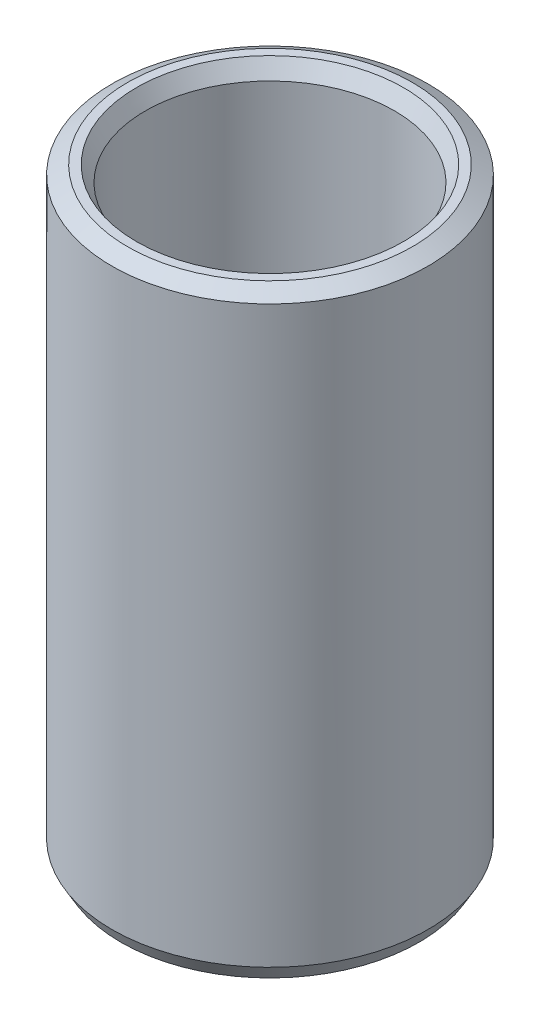
ISO-10303-21;
HEADER;
FILE_DESCRIPTION(('STEP AP214'),'2;1');
FILE_NAME('part.step','',(''),(''),'','','');
FILE_SCHEMA(('AUTOMOTIVE_DESIGN { 1 0 10303 214 1 1 1 1 }'));
ENDSEC;
DATA;
#1=APPLICATION_CONTEXT('core data for automotive mechanical design processes');
#2=APPLICATION_PROTOCOL_DEFINITION('international standard','automotive_design',2000,#1);
#3=PRODUCT_CONTEXT('',#1,'mechanical');
#4=PRODUCT('Part','Part','',(#3));
#5=PRODUCT_RELATED_PRODUCT_CATEGORY('part','',(#4));
#6=PRODUCT_DEFINITION_FORMATION('','',#4);
#7=PRODUCT_DEFINITION_CONTEXT('part definition',#1,'design');
#8=PRODUCT_DEFINITION('design','',#6,#7);
#9=PRODUCT_DEFINITION_SHAPE('','',#8);
#10=(LENGTH_UNIT() NAMED_UNIT(*) SI_UNIT(.MILLI.,.METRE.));
#11=(NAMED_UNIT(*) PLANE_ANGLE_UNIT() SI_UNIT($,.RADIAN.));
#12=(NAMED_UNIT(*) SI_UNIT($,.STERADIAN.) SOLID_ANGLE_UNIT());
#13=UNCERTAINTY_MEASURE_WITH_UNIT(LENGTH_MEASURE(1.E-05),#10,'distance_accuracy_value','');
#14=(GEOMETRIC_REPRESENTATION_CONTEXT(3) GLOBAL_UNCERTAINTY_ASSIGNED_CONTEXT((#13)) GLOBAL_UNIT_ASSIGNED_CONTEXT((#10,
#11,#12)) REPRESENTATION_CONTEXT('',''));
#15=CARTESIAN_POINT('',(0.,0.,0.));
#16=DIRECTION('',(0.,0.,1.));
#17=DIRECTION('',(1.,0.,0.));
#18=AXIS2_PLACEMENT_3D('',#15,#16,#17);
#19=CARTESIAN_POINT('',(0.,227.527161747253,0.));
#20=DIRECTION('',(0.,-1.,0.));
#21=DIRECTION('',(0.,0.,-1.));
#22=AXIS2_PLACEMENT_3D('',#19,#20,#21);
#23=CYLINDRICAL_SURFACE('',#22,60.);
#24=CARTESIAN_POINT('',(0.,5.92628424714317,0.));
#25=DIRECTION('',(0.,1.,0.));
#26=DIRECTION('',(0.,0.,1.));
#27=AXIS2_PLACEMENT_3D('',#24,#25,#26);
#28=CIRCLE('',#27,60.);
#29=CARTESIAN_POINT('',(0.,5.92628424714314,-60.));
#30=VERTEX_POINT('',#29);
#31=EDGE_CURVE('E10',#30,#30,#28,.T.);
#32=CARTESIAN_POINT('',(0.,224.105619941871,0.));
#33=DIRECTION('',(0.,1.,0.));
#34=DIRECTION('',(0.,0.,1.));
#35=AXIS2_PLACEMENT_3D('',#32,#33,#34);
#36=CIRCLE('',#35,60.);
#37=CARTESIAN_POINT('',(0.,224.105619941871,-60.));
#38=VERTEX_POINT('',#37);
#39=EDGE_CURVE('E50',#38,#38,#36,.F.);
#40=CARTESIAN_POINT('',(0.,5.92628424714314,-60.));
#41=CARTESIAN_POINT('',(0.,8.19898566062989,-60.));
#42=CARTESIAN_POINT('',(0.,10.4716870741166,-60.));
#43=CARTESIAN_POINT('',(0.,15.0170899010901,-60.));
#44=CARTESIAN_POINT('',(0.,17.2897913145769,-60.));
#45=CARTESIAN_POINT('',(0.,21.8351941415504,-60.));
#46=CARTESIAN_POINT('',(0.,24.1078955550372,-60.));
#47=CARTESIAN_POINT('',(0.,28.6532983820107,-60.));
#48=CARTESIAN_POINT('',(0.,30.9259997954974,-60.));
#49=CARTESIAN_POINT('',(0.,35.4714026224709,-60.));
#50=CARTESIAN_POINT('',(0.,37.7441040359577,-60.));
#51=CARTESIAN_POINT('',(0.,42.2895068629312,-60.));
#52=CARTESIAN_POINT('',(0.,44.5622082764179,-60.));
#53=CARTESIAN_POINT('',(0.,49.1076111033914,-60.));
#54=CARTESIAN_POINT('',(0.,51.3803125168782,-60.));
#55=CARTESIAN_POINT('',(0.,55.9257153438517,-60.));
#56=CARTESIAN_POINT('',(0.,58.1984167573384,-60.));
#57=CARTESIAN_POINT('',(0.,62.7438195843119,-60.));
#58=CARTESIAN_POINT('',(0.,65.0165209977987,-60.));
#59=CARTESIAN_POINT('',(0.,69.5619238247722,-60.));
#60=CARTESIAN_POINT('',(0.,71.8346252382589,-60.));
#61=CARTESIAN_POINT('',(0.,76.3800280652324,-60.));
#62=CARTESIAN_POINT('',(0.,78.6527294787192,-60.));
#63=CARTESIAN_POINT('',(0.,83.1981323056927,-60.));
#64=CARTESIAN_POINT('',(0.,85.4708337191794,-60.));
#65=CARTESIAN_POINT('',(0.,90.0162365461529,-60.));
#66=CARTESIAN_POINT('',(0.,92.2889379596397,-60.));
#67=CARTESIAN_POINT('',(0.,96.8343407866132,-60.));
#68=CARTESIAN_POINT('',(0.,99.1070422000999,-60.));
#69=CARTESIAN_POINT('',(0.,103.652445027073,-60.));
#70=CARTESIAN_POINT('',(0.,105.92514644056,-60.));
#71=CARTESIAN_POINT('',(0.,110.470549267534,-60.));
#72=CARTESIAN_POINT('',(0.,112.74325068102,-60.));
#73=CARTESIAN_POINT('',(0.,117.288653507994,-60.));
#74=CARTESIAN_POINT('',(0.,119.561354921481,-60.));
#75=CARTESIAN_POINT('',(0.,124.106757748454,-60.));
#76=CARTESIAN_POINT('',(0.,126.379459161941,-60.));
#77=CARTESIAN_POINT('',(0.,130.924861988914,-60.));
#78=CARTESIAN_POINT('',(0.,133.197563402401,-60.));
#79=CARTESIAN_POINT('',(0.,137.742966229375,-60.));
#80=CARTESIAN_POINT('',(0.,140.015667642861,-60.));
#81=CARTESIAN_POINT('',(0.,144.561070469835,-60.));
#82=CARTESIAN_POINT('',(0.,146.833771883322,-60.));
#83=CARTESIAN_POINT('',(0.,151.379174710295,-60.));
#84=CARTESIAN_POINT('',(0.,153.651876123782,-60.));
#85=CARTESIAN_POINT('',(0.,158.197278950755,-60.));
#86=CARTESIAN_POINT('',(0.,160.469980364242,-60.));
#87=CARTESIAN_POINT('',(0.,165.015383191216,-60.));
#88=CARTESIAN_POINT('',(0.,167.288084604702,-60.));
#89=CARTESIAN_POINT('',(0.,171.833487431676,-60.));
#90=CARTESIAN_POINT('',(0.,174.106188845163,-60.));
#91=CARTESIAN_POINT('',(0.,178.651591672136,-60.));
#92=CARTESIAN_POINT('',(0.,180.924293085623,-60.));
#93=CARTESIAN_POINT('',(0.,185.469695912596,-60.));
#94=CARTESIAN_POINT('',(0.,187.742397326083,-60.));
#95=CARTESIAN_POINT('',(0.,192.287800153057,-60.));
#96=CARTESIAN_POINT('',(0.,194.560501566543,-60.));
#97=CARTESIAN_POINT('',(0.,199.105904393517,-60.));
#98=CARTESIAN_POINT('',(0.,201.378605807004,-60.));
#99=CARTESIAN_POINT('',(0.,205.924008633977,-60.));
#100=CARTESIAN_POINT('',(0.,208.196710047464,-60.));
#101=CARTESIAN_POINT('',(0.,212.742112874437,-60.));
#102=CARTESIAN_POINT('',(0.,215.014814287924,-60.));
#103=CARTESIAN_POINT('',(0.,219.560217114898,-60.));
#104=CARTESIAN_POINT('',(0.,221.832918528384,-60.));
#105=CARTESIAN_POINT('',(0.,224.105619941871,-60.));
#106=B_SPLINE_CURVE_WITH_KNOTS('',3,(#40,#41,#42,#43,#44,#45,#46,#47,#48,#49,#50,#51,#52,#53,
#54,#55,#56,#57,#58,#59,#60,#61,#62,#63,#64,#65,#66,#67,#68,#69,#70,#71,#72,#73,#74,#75,#76,#77,
#78,#79,#80,#81,#82,#83,#84,#85,#86,#87,#88,#89,#90,#91,#92,#93,#94,#95,#96,#97,#98,#99,#100,
#101,#102,#103,#104,#105),.UNSPECIFIED.,.F.,.F.,(4,2,2,2,2,2,2,2,2,2,2,2,2,2,2,2,2,2,2,2,2,2,2,
2,2,2,2,2,2,2,2,2,4),(0.,6.81810424046025,13.6362084809205,20.4543127213808,27.272416961841,
34.0905212023013,40.9086254427615,47.7267296832218,54.544833923682,61.3629381641423,
68.1810424046026,74.9991466450628,81.817250885523,88.6353551259833,95.4534593664435,
102.271563606904,109.089667847364,115.907772087824,122.725876328285,129.543980568745,
136.362084809205,143.180189049665,149.998293290126,156.816397530586,163.634501771046,
170.452606011506,177.270710251967,184.088814492427,190.906918732887,197.725022973347,
204.543127213808,211.361231454268,218.179335694728),.UNSPECIFIED.);
#107=EDGE_CURVE('BSEAM39',#30,#38,#106,.T.);
#108=ORIENTED_EDGE('',*,*,#31,.T.);
#109=ORIENTED_EDGE('',*,*,#39,.T.);
#110=ORIENTED_EDGE('',*,*,#107,.T.);
#111=ORIENTED_EDGE('',*,*,#107,.F.);
#112=EDGE_LOOP('',(#108,#110,#109,#111));
#113=FACE_BOUND('',#112,.T.);
#114=ADVANCED_FACE('F39',(#113),#23,.T.);
#115=CARTESIAN_POINT('',(0.,227.527161747253,0.));
#116=DIRECTION('',(0.,1.,0.));
#117=DIRECTION('',(0.,0.,1.));
#118=AXIS2_PLACEMENT_3D('',#115,#116,#117);
#119=PLANE('',#118);
#120=CARTESIAN_POINT('',(0.,227.527161747253,0.));
#121=DIRECTION('',(0.,1.,0.));
#122=DIRECTION('',(0.,0.,1.));
#123=AXIS2_PLACEMENT_3D('',#120,#121,#122);
#124=CIRCLE('',#123,50.6936495553071);
#125=CARTESIAN_POINT('',(0.,227.527161747253,50.6936495553071));
#126=VERTEX_POINT('',#125);
#127=EDGE_CURVE('E58',#126,#126,#124,.F.);
#128=ORIENTED_EDGE('',*,*,#127,.T.);
#129=EDGE_LOOP('',(#128));
#130=FACE_BOUND('',#129,.T.);
#131=CARTESIAN_POINT('',(0.,227.527161747253,0.));
#132=DIRECTION('',(0.,1.,0.));
#133=DIRECTION('',(0.,0.,1.));
#134=AXIS2_PLACEMENT_3D('',#131,#132,#133);
#135=CIRCLE('',#134,54.0737157528574);
#136=CARTESIAN_POINT('',(0.,227.527161747253,-54.0737157528574));
#137=VERTEX_POINT('',#136);
#138=EDGE_CURVE('E61',#137,#137,#135,.T.);
#139=ORIENTED_EDGE('',*,*,#138,.T.);
#140=EDGE_LOOP('',(#139));
#141=FACE_BOUND('',#140,.T.);
#142=ADVANCED_FACE('F88',(#130,#141),#119,.T.);
#143=CARTESIAN_POINT('',(0.,0.,0.));
#144=DIRECTION('',(0.,1.,0.));
#145=DIRECTION('',(0.,0.,1.));
#146=AXIS2_PLACEMENT_3D('',#143,#144,#145);
#147=PLANE('',#146);
#148=CARTESIAN_POINT('',(0.,0.,0.));
#149=DIRECTION('',(0.,1.,0.));
#150=DIRECTION('',(0.,0.,1.));
#151=AXIS2_PLACEMENT_3D('',#148,#149,#150);
#152=CIRCLE('',#151,53.1983919970673);
#153=CARTESIAN_POINT('',(0.,0.,53.1983919970673));
#154=VERTEX_POINT('',#153);
#155=EDGE_CURVE('E51',#154,#154,#152,.T.);
#156=ORIENTED_EDGE('',*,*,#155,.T.);
#157=EDGE_LOOP('',(#156));
#158=FACE_BOUND('',#157,.T.);
#159=CARTESIAN_POINT('',(0.,0.,0.));
#160=DIRECTION('',(0.,1.,0.));
#161=DIRECTION('',(0.,0.,1.));
#162=AXIS2_PLACEMENT_3D('',#159,#160,#161);
#163=CIRCLE('',#162,56.5784581946176);
#164=CARTESIAN_POINT('',(0.,0.,56.5784581946176));
#165=VERTEX_POINT('',#164);
#166=EDGE_CURVE('E54',#165,#165,#163,.F.);
#167=ORIENTED_EDGE('',*,*,#166,.T.);
#168=EDGE_LOOP('',(#167));
#169=FACE_BOUND('',#168,.T.);
#170=ADVANCED_FACE('F83',(#158,#169),#147,.F.);
#171=CARTESIAN_POINT('',(0.,227.527161747253,0.));
#172=DIRECTION('',(0.,-1.,0.));
#173=DIRECTION('',(0.,0.,-1.));
#174=AXIS2_PLACEMENT_3D('',#171,#172,#173);
#175=CYLINDRICAL_SURFACE('',#174,47.2721077499247);
#176=CARTESIAN_POINT('',(0.,221.60087750011,0.));
#177=DIRECTION('',(0.,1.,0.));
#178=DIRECTION('',(0.,0.,1.));
#179=AXIS2_PLACEMENT_3D('',#176,#177,#178);
#180=CIRCLE('',#179,47.2721077499247);
#181=CARTESIAN_POINT('',(0.,221.60087750011,-47.2721077499247));
#182=VERTEX_POINT('',#181);
#183=EDGE_CURVE('E67',#182,#182,#180,.T.);
#184=CARTESIAN_POINT('',(0.,3.42154180538207,0.));
#185=DIRECTION('',(0.,1.,0.));
#186=DIRECTION('',(0.,0.,1.));
#187=AXIS2_PLACEMENT_3D('',#184,#185,#186);
#188=CIRCLE('',#187,47.2721077499247);
#189=CARTESIAN_POINT('',(0.,3.42154180538207,-47.2721077499247));
#190=VERTEX_POINT('',#189);
#191=EDGE_CURVE('E69',#190,#190,#188,.F.);
#192=CARTESIAN_POINT('',(0.,221.60087750011,-47.2721077499247));
#193=CARTESIAN_POINT('',(0.,219.328176086623,-47.2721077499247));
#194=CARTESIAN_POINT('',(0.,217.055474673136,-47.2721077499247));
#195=CARTESIAN_POINT('',(0.,212.510071846163,-47.2721077499247));
#196=CARTESIAN_POINT('',(0.,210.237370432676,-47.2721077499247));
#197=CARTESIAN_POINT('',(0.,205.691967605703,-47.2721077499247));
#198=CARTESIAN_POINT('',(0.,203.419266192216,-47.2721077499247));
#199=CARTESIAN_POINT('',(0.,198.873863365242,-47.2721077499247));
#200=CARTESIAN_POINT('',(0.,196.601161951756,-47.2721077499247));
#201=CARTESIAN_POINT('',(0.,192.055759124782,-47.2721077499247));
#202=CARTESIAN_POINT('',(0.,189.783057711295,-47.2721077499247));
#203=CARTESIAN_POINT('',(0.,185.237654884322,-47.2721077499247));
#204=CARTESIAN_POINT('',(0.,182.964953470835,-47.2721077499247));
#205=CARTESIAN_POINT('',(0.,178.419550643862,-47.2721077499247));
#206=CARTESIAN_POINT('',(0.,176.146849230375,-47.2721077499247));
#207=CARTESIAN_POINT('',(0.,171.601446403401,-47.2721077499247));
#208=CARTESIAN_POINT('',(0.,169.328744989915,-47.2721077499247));
#209=CARTESIAN_POINT('',(0.,164.783342162941,-47.2721077499247));
#210=CARTESIAN_POINT('',(0.,162.510640749454,-47.2721077499247));
#211=CARTESIAN_POINT('',(0.,157.965237922481,-47.2721077499247));
#212=CARTESIAN_POINT('',(0.,155.692536508994,-47.2721077499247));
#213=CARTESIAN_POINT('',(0.,151.147133682021,-47.2721077499247));
#214=CARTESIAN_POINT('',(0.,148.874432268534,-47.2721077499247));
#215=CARTESIAN_POINT('',(0.,144.32902944156,-47.2721077499247));
#216=CARTESIAN_POINT('',(0.,142.056328028074,-47.2721077499247));
#217=CARTESIAN_POINT('',(0.,137.5109252011,-47.2721077499247));
#218=CARTESIAN_POINT('',(0.,135.238223787613,-47.2721077499247));
#219=CARTESIAN_POINT('',(0.,130.69282096064,-47.2721077499247));
#220=CARTESIAN_POINT('',(0.,128.420119547153,-47.2721077499247));
#221=CARTESIAN_POINT('',(0.,123.87471672018,-47.2721077499247));
#222=CARTESIAN_POINT('',(0.,121.602015306693,-47.2721077499247));
#223=CARTESIAN_POINT('',(0.,117.056612479719,-47.2721077499247));
#224=CARTESIAN_POINT('',(0.,114.783911066233,-47.2721077499247));
#225=CARTESIAN_POINT('',(0.,110.238508239259,-47.2721077499247));
#226=CARTESIAN_POINT('',(0.,107.965806825773,-47.2721077499247));
#227=CARTESIAN_POINT('',(0.,103.420403998799,-47.2721077499247));
#228=CARTESIAN_POINT('',(0.,101.147702585312,-47.2721077499247));
#229=CARTESIAN_POINT('',(0.,96.6022997583388,-47.2721077499247));
#230=CARTESIAN_POINT('',(0.,94.329598344852,-47.2721077499247));
#231=CARTESIAN_POINT('',(0.,89.7841955178785,-47.2721077499247));
#232=CARTESIAN_POINT('',(0.,87.5114941043918,-47.2721077499247));
#233=CARTESIAN_POINT('',(0.,82.9660912774183,-47.2721077499247));
#234=CARTESIAN_POINT('',(0.,80.6933898639315,-47.2721077499247));
#235=CARTESIAN_POINT('',(0.,76.147987036958,-47.2721077499247));
#236=CARTESIAN_POINT('',(0.,73.8752856234713,-47.2721077499247));
#237=CARTESIAN_POINT('',(0.,69.3298827964978,-47.2721077499247));
#238=CARTESIAN_POINT('',(0.,67.057181383011,-47.2721077499247));
#239=CARTESIAN_POINT('',(0.,62.5117785560375,-47.2721077499247));
#240=CARTESIAN_POINT('',(0.,60.2390771425508,-47.2721077499247));
#241=CARTESIAN_POINT('',(0.,55.6936743155773,-47.2721077499247));
#242=CARTESIAN_POINT('',(0.,53.4209729020905,-47.2721077499247));
#243=CARTESIAN_POINT('',(0.,48.875570075117,-47.2721077499247));
#244=CARTESIAN_POINT('',(0.,46.6028686616303,-47.2721077499247));
#245=CARTESIAN_POINT('',(0.,42.0574658346568,-47.2721077499247));
#246=CARTESIAN_POINT('',(0.,39.78476442117,-47.2721077499247));
#247=CARTESIAN_POINT('',(0.,35.2393615941965,-47.2721077499247));
#248=CARTESIAN_POINT('',(0.,32.9666601807098,-47.2721077499247));
#249=CARTESIAN_POINT('',(0.,28.4212573537363,-47.2721077499247));
#250=CARTESIAN_POINT('',(0.,26.1485559402496,-47.2721077499247));
#251=CARTESIAN_POINT('',(0.,21.6031531132761,-47.2721077499247));
#252=CARTESIAN_POINT('',(0.,19.3304516997893,-47.2721077499247));
#253=CARTESIAN_POINT('',(0.,14.7850488728158,-47.2721077499247));
#254=CARTESIAN_POINT('',(0.,12.5123474593291,-47.2721077499247));
#255=CARTESIAN_POINT('',(0.,7.96694463235557,-47.2721077499247));
#256=CARTESIAN_POINT('',(0.,5.69424321886882,-47.2721077499247));
#257=CARTESIAN_POINT('',(0.,3.42154180538207,-47.2721077499247));
#258=B_SPLINE_CURVE_WITH_KNOTS('',3,(#192,#193,#194,#195,#196,#197,#198,#199,#200,#201,#202,
#203,#204,#205,#206,#207,#208,#209,#210,#211,#212,#213,#214,#215,#216,#217,#218,#219,#220,#221,
#222,#223,#224,#225,#226,#227,#228,#229,#230,#231,#232,#233,#234,#235,#236,#237,#238,#239,#240,
#241,#242,#243,#244,#245,#246,#247,#248,#249,#250,#251,#252,#253,#254,#255,#256,#257),
.UNSPECIFIED.,.F.,.F.,(4,2,2,2,2,2,2,2,2,2,2,2,2,2,2,2,2,2,2,2,2,2,2,2,2,2,2,2,2,2,2,2,4),(0.,
6.81810424046023,13.6362084809205,20.4543127213807,27.272416961841,34.0905212023012,
40.9086254427614,47.7267296832217,54.5448339236819,61.3629381641422,68.1810424046024,
74.9991466450627,81.8172508855229,88.6353551259832,95.4534593664434,102.271563606904,
109.089667847364,115.907772087824,122.725876328284,129.543980568745,136.362084809205,
143.180189049665,149.998293290125,156.816397530586,163.634501771046,170.452606011506,
177.270710251966,184.088814492427,190.906918732887,197.725022973347,204.543127213807,
211.361231454268,218.179335694728),.UNSPECIFIED.);
#259=EDGE_CURVE('BSEAM71',#182,#190,#258,.T.);
#260=ORIENTED_EDGE('',*,*,#183,.T.);
#261=ORIENTED_EDGE('',*,*,#191,.T.);
#262=ORIENTED_EDGE('',*,*,#259,.T.);
#263=ORIENTED_EDGE('',*,*,#259,.F.);
#264=EDGE_LOOP('',(#260,#262,#261,#263));
#265=FACE_BOUND('',#264,.T.);
#266=ADVANCED_FACE('F71',(#265),#175,.F.);
#267=CARTESIAN_POINT('',(0.,221.60087750011,0.));
#268=DIRECTION('',(0.,1.,0.));
#269=DIRECTION('',(0.,0.,1.));
#270=AXIS2_PLACEMENT_3D('',#267,#268,#269);
#271=CONICAL_SURFACE('',#270,47.2721077499247,0.5235987755983);
#272=ORIENTED_EDGE('',*,*,#127,.F.);
#273=EDGE_LOOP('',(#272));
#274=FACE_BOUND('',#273,.T.);
#275=ORIENTED_EDGE('',*,*,#183,.F.);
#276=EDGE_LOOP('',(#275));
#277=FACE_BOUND('',#276,.T.);
#278=ADVANCED_FACE('F77',(#274,#277),#271,.F.);
#279=CARTESIAN_POINT('',(0.,0.,0.));
#280=DIRECTION('',(0.,-1.,0.));
#281=DIRECTION('',(0.,0.,-1.));
#282=AXIS2_PLACEMENT_3D('',#279,#280,#281);
#283=CONICAL_SURFACE('',#282,53.1983919970673,1.04719755119659);
#284=ORIENTED_EDGE('',*,*,#191,.F.);
#285=EDGE_LOOP('',(#284));
#286=FACE_BOUND('',#285,.T.);
#287=ORIENTED_EDGE('',*,*,#155,.F.);
#288=EDGE_LOOP('',(#287));
#289=FACE_BOUND('',#288,.T.);
#290=ADVANCED_FACE('F73',(#286,#289),#283,.F.);
#291=CARTESIAN_POINT('',(0.,5.92628424714317,0.));
#292=DIRECTION('',(0.,1.,0.));
#293=DIRECTION('',(0.,0.,1.));
#294=AXIS2_PLACEMENT_3D('',#291,#292,#293);
#295=CONICAL_SURFACE('',#294,60.,0.523598775598304);
#296=ORIENTED_EDGE('',*,*,#166,.F.);
#297=EDGE_LOOP('',(#296));
#298=FACE_BOUND('',#297,.T.);
#299=ORIENTED_EDGE('',*,*,#31,.F.);
#300=EDGE_LOOP('',(#299));
#301=FACE_BOUND('',#300,.T.);
#302=ADVANCED_FACE('F76',(#298,#301),#295,.T.);
#303=CARTESIAN_POINT('',(0.,227.527161747253,0.));
#304=DIRECTION('',(0.,-1.,0.));
#305=DIRECTION('',(0.,0.,-1.));
#306=AXIS2_PLACEMENT_3D('',#303,#304,#305);
#307=CONICAL_SURFACE('',#306,54.0737157528574,1.0471975511966);
#308=CARTESIAN_POINT('',(0.,224.105619941871,-60.));
#309=CARTESIAN_POINT('',(0.,224.141261002344,-59.9382678724256));
#310=CARTESIAN_POINT('',(0.,224.176902062817,-59.8765357448512));
#311=CARTESIAN_POINT('',(0.,224.248184183762,-59.7530714897024));
#312=CARTESIAN_POINT('',(0.,224.283825244235,-59.691339362128));
#313=CARTESIAN_POINT('',(0.,224.35510736518,-59.5678751069792));
#314=CARTESIAN_POINT('',(0.,224.390748425653,-59.5061429794048));
#315=CARTESIAN_POINT('',(0.,224.462030546598,-59.382678724256));
#316=CARTESIAN_POINT('',(0.,224.497671607071,-59.3209465966816));
#317=CARTESIAN_POINT('',(0.,224.568953728017,-59.1974823415328));
#318=CARTESIAN_POINT('',(0.,224.604594788489,-59.1357502139584));
#319=CARTESIAN_POINT('',(0.,224.675876909435,-59.0122859588096));
#320=CARTESIAN_POINT('',(0.,224.711517969908,-58.9505538312352));
#321=CARTESIAN_POINT('',(0.,224.782800090853,-58.8270895760864));
#322=CARTESIAN_POINT('',(0.,224.818441151326,-58.765357448512));
#323=CARTESIAN_POINT('',(0.,224.889723272271,-58.6418931933632));
#324=CARTESIAN_POINT('',(0.,224.925364332744,-58.5801610657888));
#325=CARTESIAN_POINT('',(0.,224.996646453689,-58.45669681064));
#326=CARTESIAN_POINT('',(0.,225.032287514162,-58.3949646830656));
#327=CARTESIAN_POINT('',(0.,225.103569635108,-58.2715004279168));
#328=CARTESIAN_POINT('',(0.,225.13921069558,-58.2097683003424));
#329=CARTESIAN_POINT('',(0.,225.210492816526,-58.0863040451936));
#330=CARTESIAN_POINT('',(0.,225.246133876999,-58.0245719176191));
#331=CARTESIAN_POINT('',(0.,225.317415997944,-57.9011076624704));
#332=CARTESIAN_POINT('',(0.,225.353057058417,-57.839375534896));
#333=CARTESIAN_POINT('',(0.,225.424339179362,-57.7159112797471));
#334=CARTESIAN_POINT('',(0.,225.459980239835,-57.6541791521727));
#335=CARTESIAN_POINT('',(0.,225.53126236078,-57.5307148970239));
#336=CARTESIAN_POINT('',(0.,225.566903421253,-57.4689827694495));
#337=CARTESIAN_POINT('',(0.,225.638185542199,-57.3455185143007));
#338=CARTESIAN_POINT('',(0.,225.673826602671,-57.2837863867263));
#339=CARTESIAN_POINT('',(0.,225.745108723617,-57.1603221315775));
#340=CARTESIAN_POINT('',(0.,225.780749784089,-57.0985900040031));
#341=CARTESIAN_POINT('',(0.,225.852031905035,-56.9751257488543));
#342=CARTESIAN_POINT('',(0.,225.887672965508,-56.9133936212799));
#343=CARTESIAN_POINT('',(0.,225.958955086453,-56.7899293661311));
#344=CARTESIAN_POINT('',(0.,225.994596146926,-56.7281972385567));
#345=CARTESIAN_POINT('',(0.,226.065878267871,-56.6047329834079));
#346=CARTESIAN_POINT('',(0.,226.101519328344,-56.5430008558335));
#347=CARTESIAN_POINT('',(0.,226.172801449289,-56.4195366006847));
#348=CARTESIAN_POINT('',(0.,226.208442509762,-56.3578044731103));
#349=CARTESIAN_POINT('',(0.,226.279724630708,-56.2343402179615));
#350=CARTESIAN_POINT('',(0.,226.31536569118,-56.1726080903871));
#351=CARTESIAN_POINT('',(0.,226.386647812126,-56.0491438352383));
#352=CARTESIAN_POINT('',(0.,226.422288872599,-55.9874117076639));
#353=CARTESIAN_POINT('',(0.,226.493570993544,-55.8639474525151));
#354=CARTESIAN_POINT('',(0.,226.529212054017,-55.8022153249407));
#355=CARTESIAN_POINT('',(0.,226.600494174962,-55.6787510697919));
#356=CARTESIAN_POINT('',(0.,226.636135235435,-55.6170189422175));
#357=CARTESIAN_POINT('',(0.,226.70741735638,-55.4935546870687));
#358=CARTESIAN_POINT('',(0.,226.743058416853,-55.4318225594943));
#359=CARTESIAN_POINT('',(0.,226.814340537799,-55.3083583043455));
#360=CARTESIAN_POINT('',(0.,226.849981598271,-55.2466261767711));
#361=CARTESIAN_POINT('',(0.,226.921263719217,-55.1231619216223));
#362=CARTESIAN_POINT('',(0.,226.95690477969,-55.0614297940479));
#363=CARTESIAN_POINT('',(0.,227.028186900635,-54.9379655388991));
#364=CARTESIAN_POINT('',(0.,227.063827961108,-54.8762334113247));
#365=CARTESIAN_POINT('',(0.,227.135110082053,-54.7527691561759));
#366=CARTESIAN_POINT('',(0.,227.170751142526,-54.6910370286014));
#367=CARTESIAN_POINT('',(0.,227.242033263471,-54.5675727734526));
#368=CARTESIAN_POINT('',(0.,227.277674323944,-54.5058406458782));
#369=CARTESIAN_POINT('',(0.,227.34895644489,-54.3823763907294));
#370=CARTESIAN_POINT('',(0.,227.384597505362,-54.320644263155));
#371=CARTESIAN_POINT('',(0.,227.455879626308,-54.1971800080062));
#372=CARTESIAN_POINT('',(0.,227.49152068678,-54.1354478804318));
#373=CARTESIAN_POINT('',(0.,227.527161747253,-54.0737157528574));
#374=B_SPLINE_CURVE_WITH_KNOTS('',3,(#308,#309,#310,#311,#312,#313,#314,#315,#316,#317,#318,
#319,#320,#321,#322,#323,#324,#325,#326,#327,#328,#329,#330,#331,#332,#333,#334,#335,#336,#337,
#338,#339,#340,#341,#342,#343,#344,#345,#346,#347,#348,#349,#350,#351,#352,#353,#354,#355,#356,
#357,#358,#359,#360,#361,#362,#363,#364,#365,#366,#367,#368,#369,#370,#371,#372,#373),
.UNSPECIFIED.,.F.,.F.,(4,2,2,2,2,2,2,2,2,2,2,2,2,2,2,2,2,2,2,2,2,2,2,2,2,2,2,2,2,2,2,2,4),(0.,
0.213846362836379,0.427692725672758,0.641539088509144,0.855385451345503,1.06923181418189,
1.28307817701826,1.49692453985465,1.71077090269101,1.92461726552739,2.13846362836377,
2.35230999120014,2.56615635403651,2.78000271687289,2.99384907970927,3.20769544254564,
3.42154180538202,3.6353881682184,3.84923453105476,4.06308089389114,4.27692725672752,
4.4907736195639,4.70461998240026,4.91846634523664,5.13231270807302,5.34615907090939,
5.56000543374577,5.77385179658215,5.98769815941853,6.20154452225489,6.41539088509127,
6.62923724792766,6.84308361076403),.UNSPECIFIED.);
#375=EDGE_CURVE('BSEAM45',#38,#137,#374,.T.);
#376=ORIENTED_EDGE('',*,*,#39,.F.);
#377=ORIENTED_EDGE('',*,*,#138,.F.);
#378=ORIENTED_EDGE('',*,*,#375,.T.);
#379=ORIENTED_EDGE('',*,*,#375,.F.);
#380=EDGE_LOOP('',(#376,#378,#377,#379));
#381=FACE_BOUND('',#380,.T.);
#382=ADVANCED_FACE('F45',(#381),#307,.T.);
#383=CLOSED_SHELL('',(#114,#142,#170,#266,#278,#290,#302,#382));
#384=MANIFOLD_SOLID_BREP('B2',#383);
#385=ADVANCED_BREP_SHAPE_REPRESENTATION('',(#18,#384),#14);
#386=SHAPE_DEFINITION_REPRESENTATION(#9,#385);
ENDSEC;
END-ISO-10303-21;
